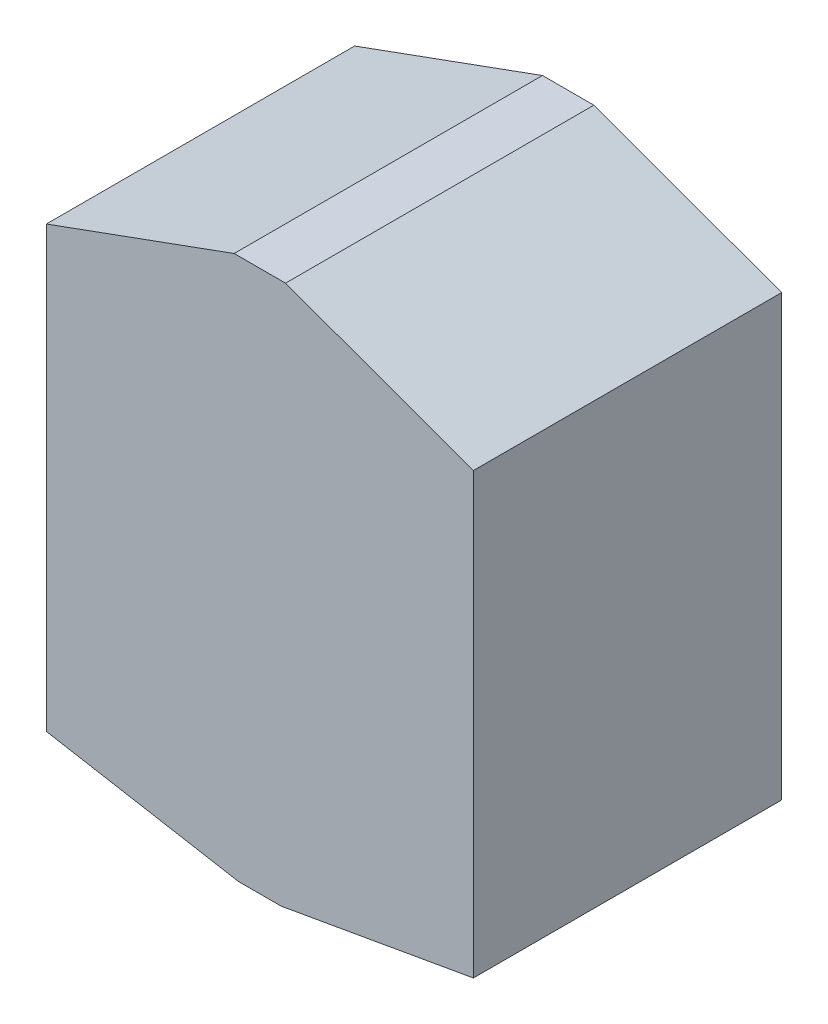
ISO-10303-21;
HEADER;
FILE_DESCRIPTION(('STEP AP214'),'2;1');
FILE_NAME('part.step','',(''),(''),'','','');
FILE_SCHEMA(('AUTOMOTIVE_DESIGN { 1 0 10303 214 1 1 1 1 }'));
ENDSEC;
DATA;
#1=APPLICATION_CONTEXT('core data for automotive mechanical design processes');
#2=APPLICATION_PROTOCOL_DEFINITION('international standard','automotive_design',2000,#1);
#3=PRODUCT_CONTEXT('',#1,'mechanical');
#4=PRODUCT('Part','Part','',(#3));
#5=PRODUCT_RELATED_PRODUCT_CATEGORY('part','',(#4));
#6=PRODUCT_DEFINITION_FORMATION('','',#4);
#7=PRODUCT_DEFINITION_CONTEXT('part definition',#1,'design');
#8=PRODUCT_DEFINITION('design','',#6,#7);
#9=PRODUCT_DEFINITION_SHAPE('','',#8);
#10=(LENGTH_UNIT() NAMED_UNIT(*) SI_UNIT(.MILLI.,.METRE.));
#11=(NAMED_UNIT(*) PLANE_ANGLE_UNIT() SI_UNIT($,.RADIAN.));
#12=(NAMED_UNIT(*) SI_UNIT($,.STERADIAN.) SOLID_ANGLE_UNIT());
#13=UNCERTAINTY_MEASURE_WITH_UNIT(LENGTH_MEASURE(1.E-05),#10,'distance_accuracy_value','');
#14=(GEOMETRIC_REPRESENTATION_CONTEXT(3) GLOBAL_UNCERTAINTY_ASSIGNED_CONTEXT((#13)) GLOBAL_UNIT_ASSIGNED_CONTEXT((#10,
#11,#12)) REPRESENTATION_CONTEXT('',''));
#15=CARTESIAN_POINT('',(0.,0.,0.));
#16=DIRECTION('',(0.,0.,1.));
#17=DIRECTION('',(1.,0.,0.));
#18=AXIS2_PLACEMENT_3D('',#15,#16,#17);
#19=CARTESIAN_POINT('',(0.,218.394934374276,30.));
#20=DIRECTION('',(0.,1.,0.));
#21=DIRECTION('',(0.,0.,1.));
#22=AXIS2_PLACEMENT_3D('',#19,#20,#21);
#23=PLANE('',#22);
#24=DIRECTION('',(1.,0.,0.));
#25=VECTOR('',#24,1.);
#26=CARTESIAN_POINT('',(0.,218.394934374276,0.));
#27=LINE('',#26,#25);
#28=CARTESIAN_POINT('',(-2.07767420970147,218.394934374276,0.));
#29=VERTEX_POINT('',#28);
#30=CARTESIAN_POINT('',(2.07767420970147,218.394934374276,0.));
#31=VERTEX_POINT('',#30);
#32=EDGE_CURVE('E150',#29,#31,#27,.T.);
#33=ORIENTED_EDGE('',*,*,#32,.T.);
#34=DIRECTION('',(0.,0.,-1.));
#35=VECTOR('',#34,1.);
#36=CARTESIAN_POINT('',(2.07767420970147,218.394934374276,30.));
#37=LINE('',#36,#35);
#38=CARTESIAN_POINT('',(2.07767420970147,218.394934374276,30.));
#39=VERTEX_POINT('',#38);
#40=EDGE_CURVE('E11',#39,#31,#37,.T.);
#41=ORIENTED_EDGE('',*,*,#40,.F.);
#42=DIRECTION('',(1.,0.,0.));
#43=VECTOR('',#42,1.);
#44=CARTESIAN_POINT('',(0.,218.394934374276,30.));
#45=LINE('',#44,#43);
#46=CARTESIAN_POINT('',(-2.07767420970147,218.394934374276,30.));
#47=VERTEX_POINT('',#46);
#48=EDGE_CURVE('E172',#47,#39,#45,.T.);
#49=ORIENTED_EDGE('',*,*,#48,.F.);
#50=DIRECTION('',(0.,0.,-1.));
#51=VECTOR('',#50,1.);
#52=CARTESIAN_POINT('',(-2.07767420970147,218.394934374276,30.));
#53=LINE('',#52,#51);
#54=EDGE_CURVE('E146',#47,#29,#53,.T.);
#55=ORIENTED_EDGE('',*,*,#54,.T.);
#56=EDGE_LOOP('',(#33,#41,#49,#55));
#57=FACE_BOUND('',#56,.T.);
#58=ADVANCED_FACE('F49',(#57),#23,.F.);
#59=CARTESIAN_POINT('',(-37.2850838349212,211.45421809591,30.));
#60=DIRECTION('',(-0.173648177666931,0.984807753012208,0.));
#61=DIRECTION('',(-0.984807753012208,-0.173648177666931,0.));
#62=AXIS2_PLACEMENT_3D('',#59,#60,#61);
#63=PLANE('',#62);
#64=DIRECTION('',(0.984807753012208,0.173648177666931,0.));
#65=VECTOR('',#64,1.);
#66=CARTESIAN_POINT('',(-37.2850838349212,211.45421809591,0.));
#67=LINE('',#66,#65);
#68=CARTESIAN_POINT('',(20.7767420970357,221.692084556912,0.));
#69=VERTEX_POINT('',#68);
#70=EDGE_CURVE('E154',#31,#69,#67,.T.);
#71=ORIENTED_EDGE('',*,*,#70,.T.);
#72=DIRECTION('',(0.,0.,-1.));
#73=VECTOR('',#72,1.);
#74=CARTESIAN_POINT('',(20.7767420970357,221.692084556912,30.));
#75=LINE('',#74,#73);
#76=CARTESIAN_POINT('',(20.7767420970357,221.692084556912,30.));
#77=VERTEX_POINT('',#76);
#78=EDGE_CURVE('E58',#77,#69,#75,.T.);
#79=ORIENTED_EDGE('',*,*,#78,.F.);
#80=DIRECTION('',(0.984807753012208,0.173648177666931,0.));
#81=VECTOR('',#80,1.);
#82=CARTESIAN_POINT('',(-37.2850838349212,211.45421809591,30.));
#83=LINE('',#82,#81);
#84=EDGE_CURVE('E109',#39,#77,#83,.T.);
#85=ORIENTED_EDGE('',*,*,#84,.F.);
#86=ORIENTED_EDGE('',*,*,#40,.T.);
#87=EDGE_LOOP('',(#71,#79,#85,#86));
#88=FACE_BOUND('',#87,.T.);
#89=ADVANCED_FACE('F218',(#88),#63,.F.);
#90=CARTESIAN_POINT('',(20.7767420970356,0.,30.));
#91=DIRECTION('',(-1.,0.,0.));
#92=DIRECTION('',(0.,-1.,0.));
#93=AXIS2_PLACEMENT_3D('',#90,#91,#92);
#94=PLANE('',#93);
#95=DIRECTION('',(0.,1.,0.));
#96=VECTOR('',#95,1.);
#97=CARTESIAN_POINT('',(20.7767420970356,0.,0.));
#98=LINE('',#97,#96);
#99=CARTESIAN_POINT('',(20.7767420970357,264.456364549561,0.));
#100=VERTEX_POINT('',#99);
#101=EDGE_CURVE('E157',#69,#100,#98,.T.);
#102=ORIENTED_EDGE('',*,*,#101,.T.);
#103=DIRECTION('',(0.,0.,-1.));
#104=VECTOR('',#103,1.);
#105=CARTESIAN_POINT('',(20.7767420970357,264.456364549561,30.));
#106=LINE('',#105,#104);
#107=CARTESIAN_POINT('',(20.7767420970357,264.456364549561,30.));
#108=VERTEX_POINT('',#107);
#109=EDGE_CURVE('E183',#108,#100,#106,.T.);
#110=ORIENTED_EDGE('',*,*,#109,.F.);
#111=DIRECTION('',(0.,1.,0.));
#112=VECTOR('',#111,1.);
#113=CARTESIAN_POINT('',(20.7767420970356,0.,30.));
#114=LINE('',#113,#112);
#115=EDGE_CURVE('E193',#77,#108,#114,.T.);
#116=ORIENTED_EDGE('',*,*,#115,.F.);
#117=ORIENTED_EDGE('',*,*,#78,.T.);
#118=EDGE_LOOP('',(#102,#110,#116,#117));
#119=FACE_BOUND('',#118,.T.);
#120=ADVANCED_FACE('F191',(#119),#94,.F.);
#121=CARTESIAN_POINT('',(87.4250543513432,240.198362724914,30.));
#122=DIRECTION('',(-0.342020143325662,-0.939692620785911,0.));
#123=DIRECTION('',(0.939692620785911,-0.342020143325662,0.));
#124=AXIS2_PLACEMENT_3D('',#121,#122,#123);
#125=PLANE('',#124);
#126=DIRECTION('',(-0.939692620785911,0.342020143325662,0.));
#127=VECTOR('',#126,1.);
#128=CARTESIAN_POINT('',(87.4250543513432,240.198362724914,0.));
#129=LINE('',#128,#127);
#130=CARTESIAN_POINT('',(2.4999999999996,271.108554652242,0.));
#131=VERTEX_POINT('',#130);
#132=EDGE_CURVE('E160',#100,#131,#129,.T.);
#133=ORIENTED_EDGE('',*,*,#132,.T.);
#134=DIRECTION('',(0.,0.,-1.));
#135=VECTOR('',#134,1.);
#136=CARTESIAN_POINT('',(2.4999999999996,271.108554652242,30.));
#137=LINE('',#136,#135);
#138=CARTESIAN_POINT('',(2.4999999999996,271.108554652242,30.));
#139=VERTEX_POINT('',#138);
#140=EDGE_CURVE('E179',#139,#131,#137,.T.);
#141=ORIENTED_EDGE('',*,*,#140,.F.);
#142=DIRECTION('',(-0.939692620785911,0.342020143325662,0.));
#143=VECTOR('',#142,1.);
#144=CARTESIAN_POINT('',(87.4250543513432,240.198362724914,30.));
#145=LINE('',#144,#143);
#146=EDGE_CURVE('E206',#108,#139,#145,.T.);
#147=ORIENTED_EDGE('',*,*,#146,.F.);
#148=ORIENTED_EDGE('',*,*,#109,.T.);
#149=EDGE_LOOP('',(#133,#141,#147,#148));
#150=FACE_BOUND('',#149,.T.);
#151=ADVANCED_FACE('F201',(#150),#125,.F.);
#152=CARTESIAN_POINT('',(0.,271.108554652242,30.));
#153=DIRECTION('',(0.,-1.,0.));
#154=DIRECTION('',(0.,0.,-1.));
#155=AXIS2_PLACEMENT_3D('',#152,#153,#154);
#156=PLANE('',#155);
#157=DIRECTION('',(-1.,0.,0.));
#158=VECTOR('',#157,1.);
#159=CARTESIAN_POINT('',(0.,271.108554652242,0.));
#160=LINE('',#159,#158);
#161=CARTESIAN_POINT('',(-2.50000000000039,271.108554652242,0.));
#162=VERTEX_POINT('',#161);
#163=EDGE_CURVE('E163',#131,#162,#160,.T.);
#164=ORIENTED_EDGE('',*,*,#163,.T.);
#165=DIRECTION('',(0.,0.,-1.));
#166=VECTOR('',#165,1.);
#167=CARTESIAN_POINT('',(-2.50000000000039,271.108554652242,30.));
#168=LINE('',#167,#166);
#169=CARTESIAN_POINT('',(-2.50000000000039,271.108554652242,30.));
#170=VERTEX_POINT('',#169);
#171=EDGE_CURVE('E139',#170,#162,#168,.T.);
#172=ORIENTED_EDGE('',*,*,#171,.F.);
#173=DIRECTION('',(-1.,0.,0.));
#174=VECTOR('',#173,1.);
#175=CARTESIAN_POINT('',(0.,271.108554652242,30.));
#176=LINE('',#175,#174);
#177=EDGE_CURVE('E128',#139,#170,#176,.T.);
#178=ORIENTED_EDGE('',*,*,#177,.F.);
#179=ORIENTED_EDGE('',*,*,#140,.T.);
#180=EDGE_LOOP('',(#164,#172,#178,#179));
#181=FACE_BOUND('',#180,.T.);
#182=ADVANCED_FACE('F204',(#181),#156,.F.);
#183=CARTESIAN_POINT('',(-87.4250543513451,240.198362724913,30.));
#184=DIRECTION('',(0.34202014332567,-0.939692620785908,0.));
#185=DIRECTION('',(0.939692620785908,0.34202014332567,0.));
#186=AXIS2_PLACEMENT_3D('',#183,#184,#185);
#187=PLANE('',#186);
#188=DIRECTION('',(-0.939692620785908,-0.34202014332567,0.));
#189=VECTOR('',#188,1.);
#190=CARTESIAN_POINT('',(-87.4250543513451,240.198362724913,0.));
#191=LINE('',#190,#189);
#192=CARTESIAN_POINT('',(-20.7767420970357,264.456364549561,0.));
#193=VERTEX_POINT('',#192);
#194=EDGE_CURVE('E137',#162,#193,#191,.T.);
#195=ORIENTED_EDGE('',*,*,#194,.T.);
#196=DIRECTION('',(0.,0.,-1.));
#197=VECTOR('',#196,1.);
#198=CARTESIAN_POINT('',(-20.7767420970357,264.456364549561,30.));
#199=LINE('',#198,#197);
#200=CARTESIAN_POINT('',(-20.7767420970357,264.456364549561,30.));
#201=VERTEX_POINT('',#200);
#202=EDGE_CURVE('E134',#201,#193,#199,.T.);
#203=ORIENTED_EDGE('',*,*,#202,.F.);
#204=DIRECTION('',(-0.939692620785908,-0.34202014332567,0.));
#205=VECTOR('',#204,1.);
#206=CARTESIAN_POINT('',(-87.4250543513451,240.198362724913,30.));
#207=LINE('',#206,#205);
#208=EDGE_CURVE('E122',#170,#201,#207,.T.);
#209=ORIENTED_EDGE('',*,*,#208,.F.);
#210=ORIENTED_EDGE('',*,*,#171,.T.);
#211=EDGE_LOOP('',(#195,#203,#209,#210));
#212=FACE_BOUND('',#211,.T.);
#213=ADVANCED_FACE('F135',(#212),#187,.F.);
#214=CARTESIAN_POINT('',(-20.7767420970357,0.,30.));
#215=DIRECTION('',(1.,0.,0.));
#216=DIRECTION('',(0.,1.,0.));
#217=AXIS2_PLACEMENT_3D('',#214,#215,#216);
#218=PLANE('',#217);
#219=DIRECTION('',(0.,-1.,0.));
#220=VECTOR('',#219,1.);
#221=CARTESIAN_POINT('',(-20.7767420970357,0.,0.));
#222=LINE('',#221,#220);
#223=CARTESIAN_POINT('',(-20.7767420970357,221.692084556912,0.));
#224=VERTEX_POINT('',#223);
#225=EDGE_CURVE('E95',#193,#224,#222,.T.);
#226=ORIENTED_EDGE('',*,*,#225,.T.);
#227=DIRECTION('',(0.,0.,-1.));
#228=VECTOR('',#227,1.);
#229=CARTESIAN_POINT('',(-20.7767420970357,221.692084556912,30.));
#230=LINE('',#229,#228);
#231=CARTESIAN_POINT('',(-20.7767420970357,221.692084556912,30.));
#232=VERTEX_POINT('',#231);
#233=EDGE_CURVE('E140',#232,#224,#230,.T.);
#234=ORIENTED_EDGE('',*,*,#233,.F.);
#235=DIRECTION('',(0.,-1.,0.));
#236=VECTOR('',#235,1.);
#237=CARTESIAN_POINT('',(-20.7767420970357,0.,30.));
#238=LINE('',#237,#236);
#239=EDGE_CURVE('E126',#201,#232,#238,.T.);
#240=ORIENTED_EDGE('',*,*,#239,.F.);
#241=ORIENTED_EDGE('',*,*,#202,.T.);
#242=EDGE_LOOP('',(#226,#234,#240,#241));
#243=FACE_BOUND('',#242,.T.);
#244=ADVANCED_FACE('F142',(#243),#218,.F.);
#245=CARTESIAN_POINT('',(37.2850838349212,211.45421809591,30.));
#246=DIRECTION('',(0.173648177666931,0.984807753012208,0.));
#247=DIRECTION('',(-0.984807753012208,0.173648177666931,0.));
#248=AXIS2_PLACEMENT_3D('',#245,#246,#247);
#249=PLANE('',#248);
#250=DIRECTION('',(0.984807753012208,-0.173648177666931,0.));
#251=VECTOR('',#250,1.);
#252=CARTESIAN_POINT('',(37.2850838349212,211.45421809591,0.));
#253=LINE('',#252,#251);
#254=EDGE_CURVE('E101',#224,#29,#253,.T.);
#255=ORIENTED_EDGE('',*,*,#254,.T.);
#256=ORIENTED_EDGE('',*,*,#54,.F.);
#257=DIRECTION('',(0.984807753012208,-0.173648177666931,0.));
#258=VECTOR('',#257,1.);
#259=CARTESIAN_POINT('',(37.2850838349212,211.45421809591,30.));
#260=LINE('',#259,#258);
#261=EDGE_CURVE('E66',#232,#47,#260,.T.);
#262=ORIENTED_EDGE('',*,*,#261,.F.);
#263=ORIENTED_EDGE('',*,*,#233,.T.);
#264=EDGE_LOOP('',(#255,#256,#262,#263));
#265=FACE_BOUND('',#264,.T.);
#266=ADVANCED_FACE('F233',(#265),#249,.F.);
#267=CARTESIAN_POINT('',(0.,0.,30.));
#268=DIRECTION('',(0.,0.,1.));
#269=DIRECTION('',(1.,0.,0.));
#270=AXIS2_PLACEMENT_3D('',#267,#268,#269);
#271=PLANE('',#270);
#272=ORIENTED_EDGE('',*,*,#48,.T.);
#273=ORIENTED_EDGE('',*,*,#84,.T.);
#274=ORIENTED_EDGE('',*,*,#115,.T.);
#275=ORIENTED_EDGE('',*,*,#146,.T.);
#276=ORIENTED_EDGE('',*,*,#177,.T.);
#277=ORIENTED_EDGE('',*,*,#208,.T.);
#278=ORIENTED_EDGE('',*,*,#239,.T.);
#279=ORIENTED_EDGE('',*,*,#261,.T.);
#280=EDGE_LOOP('',(#272,#273,#274,#275,#276,#277,#278,#279));
#281=FACE_BOUND('',#280,.T.);
#282=ADVANCED_FACE('F124',(#281),#271,.T.);
#283=CARTESIAN_POINT('',(0.,0.,0.));
#284=DIRECTION('',(0.,0.,1.));
#285=DIRECTION('',(1.,0.,0.));
#286=AXIS2_PLACEMENT_3D('',#283,#284,#285);
#287=PLANE('',#286);
#288=ORIENTED_EDGE('',*,*,#32,.F.);
#289=ORIENTED_EDGE('',*,*,#254,.F.);
#290=ORIENTED_EDGE('',*,*,#225,.F.);
#291=ORIENTED_EDGE('',*,*,#194,.F.);
#292=ORIENTED_EDGE('',*,*,#163,.F.);
#293=ORIENTED_EDGE('',*,*,#132,.F.);
#294=ORIENTED_EDGE('',*,*,#101,.F.);
#295=ORIENTED_EDGE('',*,*,#70,.F.);
#296=EDGE_LOOP('',(#288,#289,#290,#291,#292,#293,#294,#295));
#297=FACE_BOUND('',#296,.T.);
#298=ADVANCED_FACE('F197',(#297),#287,.F.);
#299=CLOSED_SHELL('',(#58,#89,#120,#151,#182,#213,#244,#266,#282,#298));
#300=MANIFOLD_SOLID_BREP('B2',#299);
#301=ADVANCED_BREP_SHAPE_REPRESENTATION('',(#18,#300),#14);
#302=SHAPE_DEFINITION_REPRESENTATION(#9,#301);
ENDSEC;
END-ISO-10303-21;
